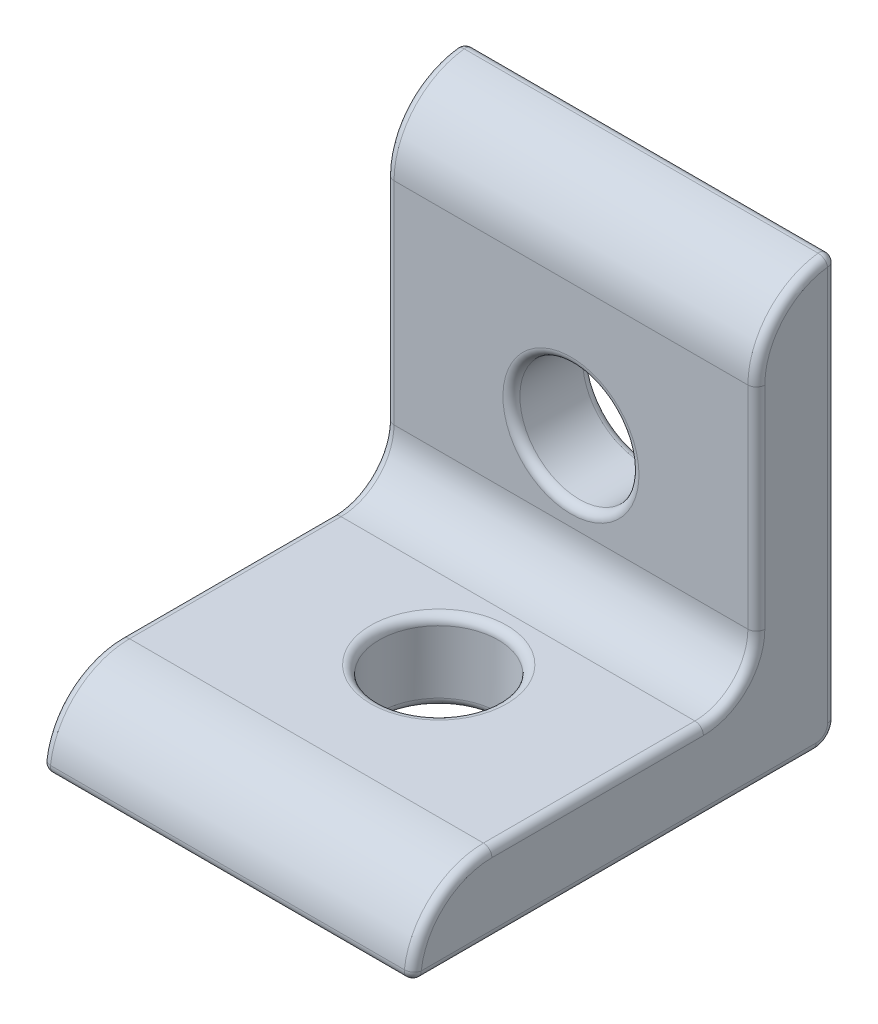
ISO-10303-21;
HEADER;
FILE_DESCRIPTION(('STEP AP214'),'2;1');
FILE_NAME('part.step','',(''),(''),'','','');
FILE_SCHEMA(('AUTOMOTIVE_DESIGN { 1 0 10303 214 1 1 1 1 }'));
ENDSEC;
DATA;
#1=APPLICATION_CONTEXT('core data for automotive mechanical design processes');
#2=APPLICATION_PROTOCOL_DEFINITION('international standard','automotive_design',2000,#1);
#3=PRODUCT_CONTEXT('',#1,'mechanical');
#4=PRODUCT('Part','Part','',(#3));
#5=PRODUCT_RELATED_PRODUCT_CATEGORY('part','',(#4));
#6=PRODUCT_DEFINITION_FORMATION('','',#4);
#7=PRODUCT_DEFINITION_CONTEXT('part definition',#1,'design');
#8=PRODUCT_DEFINITION('design','',#6,#7);
#9=PRODUCT_DEFINITION_SHAPE('','',#8);
#10=(LENGTH_UNIT() NAMED_UNIT(*) SI_UNIT(.MILLI.,.METRE.));
#11=(NAMED_UNIT(*) PLANE_ANGLE_UNIT() SI_UNIT($,.RADIAN.));
#12=(NAMED_UNIT(*) SI_UNIT($,.STERADIAN.) SOLID_ANGLE_UNIT());
#13=UNCERTAINTY_MEASURE_WITH_UNIT(LENGTH_MEASURE(1.E-05),#10,'distance_accuracy_value','');
#14=(GEOMETRIC_REPRESENTATION_CONTEXT(3) GLOBAL_UNCERTAINTY_ASSIGNED_CONTEXT((#13)) GLOBAL_UNIT_ASSIGNED_CONTEXT((#10,
#11,#12)) REPRESENTATION_CONTEXT('',''));
#15=CARTESIAN_POINT('',(0.,0.,0.));
#16=DIRECTION('',(0.,0.,1.));
#17=DIRECTION('',(1.,0.,0.));
#18=AXIS2_PLACEMENT_3D('',#15,#16,#17);
#19=CARTESIAN_POINT('',(-11.1125,-12.7,15.8496));
#20=DIRECTION('',(1.,0.,0.));
#21=DIRECTION('',(0.,0.,-1.));
#22=AXIS2_PLACEMENT_3D('',#19,#20,#21);
#23=CYLINDRICAL_SURFACE('',#22,4.7752);
#24=DIRECTION('',(1.,0.,0.));
#25=VECTOR('',#24,1.);
#26=CARTESIAN_POINT('',(-11.1125,-7.9248,15.8496));
#27=LINE('',#26,#25);
#28=CARTESIAN_POINT('',(-10.6045,-7.9248,15.8496));
#29=VERTEX_POINT('',#28);
#30=CARTESIAN_POINT('',(10.6045,-7.9248,15.8496));
#31=VERTEX_POINT('',#30);
#32=EDGE_CURVE('E215',#29,#31,#27,.T.);
#33=ORIENTED_EDGE('',*,*,#32,.F.);
#34=CARTESIAN_POINT('',(-10.6045,-12.7,15.8496));
#35=DIRECTION('',(1.,0.,0.));
#36=DIRECTION('',(0.,0.,-1.));
#37=AXIS2_PLACEMENT_3D('',#34,#35,#36);
#38=CIRCLE('',#37,4.7752);
#39=CARTESIAN_POINT('',(-10.6045,-12.1315238095238,20.5908413839481));
#40=VERTEX_POINT('',#39);
#41=EDGE_CURVE('E290',#29,#40,#38,.T.);
#42=ORIENTED_EDGE('',*,*,#41,.T.);
#43=DIRECTION('',(1.,0.,0.));
#44=VECTOR('',#43,1.);
#45=CARTESIAN_POINT('',(-11.1125,-12.1315238095238,20.5908413839481));
#46=LINE('',#45,#44);
#47=CARTESIAN_POINT('',(10.6045,-12.1315238095238,20.5908413839481));
#48=VERTEX_POINT('',#47);
#49=EDGE_CURVE('E284',#40,#48,#46,.T.);
#50=ORIENTED_EDGE('',*,*,#49,.T.);
#51=CARTESIAN_POINT('',(10.6045,-12.7,15.8496));
#52=DIRECTION('',(1.,0.,0.));
#53=DIRECTION('',(0.,0.,-1.));
#54=AXIS2_PLACEMENT_3D('',#51,#52,#53);
#55=CIRCLE('',#54,4.7752);
#56=EDGE_CURVE('E287',#48,#31,#55,.F.);
#57=ORIENTED_EDGE('',*,*,#56,.T.);
#58=EDGE_LOOP('',(#33,#42,#50,#57));
#59=FACE_BOUND('',#58,.T.);
#60=ADVANCED_FACE('F47',(#59),#23,.T.);
#61=CARTESIAN_POINT('',(-11.1125,-7.9248,3.175));
#62=DIRECTION('',(0.,1.,0.));
#63=DIRECTION('',(0.,0.,1.));
#64=AXIS2_PLACEMENT_3D('',#61,#62,#63);
#65=PLANE('',#64);
#66=CARTESIAN_POINT('',(0.,-7.9248,7.9248));
#67=DIRECTION('',(0.,1.,0.));
#68=DIRECTION('',(0.,0.,1.));
#69=AXIS2_PLACEMENT_3D('',#66,#67,#68);
#70=CIRCLE('',#69,4.0767);
#71=CARTESIAN_POINT('',(0.,-7.9248,12.0015));
#72=VERTEX_POINT('',#71);
#73=EDGE_CURVE('E422',#72,#72,#70,.F.);
#74=ORIENTED_EDGE('',*,*,#73,.T.);
#75=EDGE_LOOP('',(#74));
#76=FACE_BOUND('',#75,.T.);
#77=DIRECTION('',(1.,0.,0.));
#78=VECTOR('',#77,1.);
#79=CARTESIAN_POINT('',(-11.1125,-7.9248,3.175));
#80=LINE('',#79,#78);
#81=CARTESIAN_POINT('',(-10.6045,-7.9248,3.175));
#82=VERTEX_POINT('',#81);
#83=CARTESIAN_POINT('',(10.6045,-7.9248,3.175));
#84=VERTEX_POINT('',#83);
#85=EDGE_CURVE('E222',#82,#84,#80,.T.);
#86=ORIENTED_EDGE('',*,*,#85,.F.);
#87=DIRECTION('',(0.,0.,1.));
#88=VECTOR('',#87,1.);
#89=CARTESIAN_POINT('',(-10.6045,-7.9248,15.8496));
#90=LINE('',#89,#88);
#91=EDGE_CURVE('E297',#82,#29,#90,.T.);
#92=ORIENTED_EDGE('',*,*,#91,.T.);
#93=ORIENTED_EDGE('',*,*,#32,.T.);
#94=DIRECTION('',(0.,0.,1.));
#95=VECTOR('',#94,1.);
#96=CARTESIAN_POINT('',(10.6045,-7.9248,3.175));
#97=LINE('',#96,#95);
#98=EDGE_CURVE('E294',#31,#84,#97,.F.);
#99=ORIENTED_EDGE('',*,*,#98,.T.);
#100=EDGE_LOOP('',(#86,#92,#93,#99));
#101=FACE_BOUND('',#100,.T.);
#102=ADVANCED_FACE('F531',(#76,#101),#65,.T.);
#103=CARTESIAN_POINT('',(-11.1125,-4.7498,3.175));
#104=DIRECTION('',(1.,0.,0.));
#105=DIRECTION('',(0.,0.,-1.));
#106=AXIS2_PLACEMENT_3D('',#103,#104,#105);
#107=CYLINDRICAL_SURFACE('',#106,3.175);
#108=DIRECTION('',(1.,0.,0.));
#109=VECTOR('',#108,1.);
#110=CARTESIAN_POINT('',(-11.1125,-4.7498,0.));
#111=LINE('',#110,#109);
#112=CARTESIAN_POINT('',(-10.6045,-4.7498,0.));
#113=VERTEX_POINT('',#112);
#114=CARTESIAN_POINT('',(10.6045,-4.7498,0.));
#115=VERTEX_POINT('',#114);
#116=EDGE_CURVE('E613',#113,#115,#111,.T.);
#117=ORIENTED_EDGE('',*,*,#116,.F.);
#118=CARTESIAN_POINT('',(-10.6045,-4.7498,3.175));
#119=DIRECTION('',(1.,0.,0.));
#120=DIRECTION('',(0.,0.,-1.));
#121=AXIS2_PLACEMENT_3D('',#118,#119,#120);
#122=CIRCLE('',#121,3.175);
#123=EDGE_CURVE('E303',#113,#82,#122,.F.);
#124=ORIENTED_EDGE('',*,*,#123,.T.);
#125=ORIENTED_EDGE('',*,*,#85,.T.);
#126=CARTESIAN_POINT('',(10.6045,-4.7498,3.175));
#127=DIRECTION('',(1.,0.,0.));
#128=DIRECTION('',(0.,0.,-1.));
#129=AXIS2_PLACEMENT_3D('',#126,#127,#128);
#130=CIRCLE('',#129,3.175);
#131=EDGE_CURVE('E300',#84,#115,#130,.T.);
#132=ORIENTED_EDGE('',*,*,#131,.T.);
#133=EDGE_LOOP('',(#117,#124,#125,#132));
#134=FACE_BOUND('',#133,.T.);
#135=ADVANCED_FACE('F537',(#134),#107,.F.);
#136=CARTESIAN_POINT('',(-11.1125,7.9248,0.));
#137=DIRECTION('',(0.,0.,1.));
#138=DIRECTION('',(0.,-1.,0.));
#139=AXIS2_PLACEMENT_3D('',#136,#137,#138);
#140=PLANE('',#139);
#141=CARTESIAN_POINT('',(0.,0.,0.));
#142=DIRECTION('',(0.,0.,1.));
#143=DIRECTION('',(0.,-1.,0.));
#144=AXIS2_PLACEMENT_3D('',#141,#142,#143);
#145=CIRCLE('',#144,4.0767);
#146=CARTESIAN_POINT('',(0.,-4.0767,0.));
#147=VERTEX_POINT('',#146);
#148=EDGE_CURVE('E56',#147,#147,#145,.F.);
#149=ORIENTED_EDGE('',*,*,#148,.T.);
#150=EDGE_LOOP('',(#149));
#151=FACE_BOUND('',#150,.T.);
#152=DIRECTION('',(1.,0.,0.));
#153=VECTOR('',#152,1.);
#154=CARTESIAN_POINT('',(-11.1125,7.9248,0.));
#155=LINE('',#154,#153);
#156=CARTESIAN_POINT('',(-10.6045,7.9248,0.));
#157=VERTEX_POINT('',#156);
#158=CARTESIAN_POINT('',(10.6045,7.9248,0.));
#159=VERTEX_POINT('',#158);
#160=EDGE_CURVE('E225',#157,#159,#155,.T.);
#161=ORIENTED_EDGE('',*,*,#160,.F.);
#162=DIRECTION('',(0.,-1.,0.));
#163=VECTOR('',#162,1.);
#164=CARTESIAN_POINT('',(-10.6045,-4.7498,0.));
#165=LINE('',#164,#163);
#166=EDGE_CURVE('E309',#157,#113,#165,.T.);
#167=ORIENTED_EDGE('',*,*,#166,.T.);
#168=ORIENTED_EDGE('',*,*,#116,.T.);
#169=DIRECTION('',(0.,-1.,0.));
#170=VECTOR('',#169,1.);
#171=CARTESIAN_POINT('',(10.6045,7.9248,0.));
#172=LINE('',#171,#170);
#173=EDGE_CURVE('E306',#115,#159,#172,.F.);
#174=ORIENTED_EDGE('',*,*,#173,.T.);
#175=EDGE_LOOP('',(#161,#167,#168,#174));
#176=FACE_BOUND('',#175,.T.);
#177=ADVANCED_FACE('F438',(#151,#176),#140,.T.);
#178=CARTESIAN_POINT('',(-11.1125,7.9248,-4.7752));
#179=DIRECTION('',(1.,0.,0.));
#180=DIRECTION('',(0.,0.,-1.));
#181=AXIS2_PLACEMENT_3D('',#178,#179,#180);
#182=CYLINDRICAL_SURFACE('',#181,4.7752);
#183=DIRECTION('',(1.,0.,0.));
#184=VECTOR('',#183,1.);
#185=CARTESIAN_POINT('',(-11.1125,12.6660413839481,-4.20672380952381));
#186=LINE('',#185,#184);
#187=CARTESIAN_POINT('',(10.6045,12.6660413839481,-4.20672380952381));
#188=VERTEX_POINT('',#187);
#189=CARTESIAN_POINT('',(-10.6045,12.6660413839481,-4.20672380952381));
#190=VERTEX_POINT('',#189);
#191=EDGE_CURVE('E63',#188,#190,#186,.F.);
#192=ORIENTED_EDGE('',*,*,#191,.T.);
#193=CARTESIAN_POINT('',(-10.6045,7.9248,-4.7752));
#194=DIRECTION('',(1.,0.,0.));
#195=DIRECTION('',(0.,0.,-1.));
#196=AXIS2_PLACEMENT_3D('',#193,#194,#195);
#197=CIRCLE('',#196,4.7752);
#198=EDGE_CURVE('E329',#190,#157,#197,.T.);
#199=ORIENTED_EDGE('',*,*,#198,.T.);
#200=ORIENTED_EDGE('',*,*,#160,.T.);
#201=CARTESIAN_POINT('',(10.6045,7.9248,-4.7752));
#202=DIRECTION('',(1.,0.,0.));
#203=DIRECTION('',(0.,0.,-1.));
#204=AXIS2_PLACEMENT_3D('',#201,#202,#203);
#205=CIRCLE('',#204,4.7752);
#206=EDGE_CURVE('E68',#159,#188,#205,.F.);
#207=ORIENTED_EDGE('',*,*,#206,.T.);
#208=EDGE_LOOP('',(#192,#199,#200,#207));
#209=FACE_BOUND('',#208,.T.);
#210=ADVANCED_FACE('F461',(#209),#182,.T.);
#211=CARTESIAN_POINT('',(-11.1125,-12.7,-4.7752));
#212=DIRECTION('',(0.,0.,-1.));
#213=DIRECTION('',(-1.,0.,0.));
#214=AXIS2_PLACEMENT_3D('',#211,#212,#213);
#215=PLANE('',#214);
#216=CARTESIAN_POINT('',(0.,0.,-4.7752));
#217=DIRECTION('',(0.,0.,-1.));
#218=DIRECTION('',(-1.,0.,0.));
#219=AXIS2_PLACEMENT_3D('',#216,#217,#218);
#220=CIRCLE('',#219,4.0767);
#221=CARTESIAN_POINT('',(-4.0767,0.,-4.7752));
#222=VERTEX_POINT('',#221);
#223=EDGE_CURVE('E11',#222,#222,#220,.F.);
#224=ORIENTED_EDGE('',*,*,#223,.T.);
#225=EDGE_LOOP('',(#224));
#226=FACE_BOUND('',#225,.T.);
#227=DIRECTION('',(1.,0.,0.));
#228=VECTOR('',#227,1.);
#229=CARTESIAN_POINT('',(-11.1125,-11.5062,-4.7752));
#230=LINE('',#229,#228);
#231=CARTESIAN_POINT('',(10.6045,-11.5062,-4.7752));
#232=VERTEX_POINT('',#231);
#233=CARTESIAN_POINT('',(-10.6045,-11.5062,-4.7752));
#234=VERTEX_POINT('',#233);
#235=EDGE_CURVE('E214',#232,#234,#230,.F.);
#236=ORIENTED_EDGE('',*,*,#235,.T.);
#237=DIRECTION('',(0.,1.,0.));
#238=VECTOR('',#237,1.);
#239=CARTESIAN_POINT('',(-10.6045,12.7,-4.7752));
#240=LINE('',#239,#238);
#241=CARTESIAN_POINT('',(-10.6045,12.161654002677,-4.7752));
#242=VERTEX_POINT('',#241);
#243=EDGE_CURVE('E322',#234,#242,#240,.T.);
#244=ORIENTED_EDGE('',*,*,#243,.T.);
#245=DIRECTION('',(1.,0.,0.));
#246=VECTOR('',#245,1.);
#247=CARTESIAN_POINT('',(-11.1125,12.161654002677,-4.7752));
#248=LINE('',#247,#246);
#249=CARTESIAN_POINT('',(10.6045,12.161654002677,-4.7752));
#250=VERTEX_POINT('',#249);
#251=EDGE_CURVE('E319',#242,#250,#248,.T.);
#252=ORIENTED_EDGE('',*,*,#251,.T.);
#253=DIRECTION('',(0.,1.,0.));
#254=VECTOR('',#253,1.);
#255=CARTESIAN_POINT('',(10.6045,-12.7,-4.7752));
#256=LINE('',#255,#254);
#257=EDGE_CURVE('E316',#250,#232,#256,.F.);
#258=ORIENTED_EDGE('',*,*,#257,.T.);
#259=EDGE_LOOP('',(#236,#244,#252,#258));
#260=FACE_BOUND('',#259,.T.);
#261=ADVANCED_FACE('F458',(#226,#260),#215,.T.);
#262=CARTESIAN_POINT('',(-11.1125,-12.7,20.6248));
#263=DIRECTION('',(0.,-1.,0.));
#264=DIRECTION('',(0.,0.,-1.));
#265=AXIS2_PLACEMENT_3D('',#262,#263,#264);
#266=PLANE('',#265);
#267=CARTESIAN_POINT('',(0.,-12.7,7.9248));
#268=DIRECTION('',(0.,-1.,0.));
#269=DIRECTION('',(0.,0.,-1.));
#270=AXIS2_PLACEMENT_3D('',#267,#268,#269);
#271=CIRCLE('',#270,4.0767);
#272=CARTESIAN_POINT('',(0.,-12.7,3.8481));
#273=VERTEX_POINT('',#272);
#274=EDGE_CURVE('E208',#273,#273,#271,.F.);
#275=ORIENTED_EDGE('',*,*,#274,.T.);
#276=EDGE_LOOP('',(#275));
#277=FACE_BOUND('',#276,.T.);
#278=DIRECTION('',(1.,0.,0.));
#279=VECTOR('',#278,1.);
#280=CARTESIAN_POINT('',(-11.1125,-12.7,20.086454002677));
#281=LINE('',#280,#279);
#282=CARTESIAN_POINT('',(10.6045,-12.7,20.086454002677));
#283=VERTEX_POINT('',#282);
#284=CARTESIAN_POINT('',(-10.6045,-12.7,20.086454002677));
#285=VERTEX_POINT('',#284);
#286=EDGE_CURVE('E205',#283,#285,#281,.F.);
#287=ORIENTED_EDGE('',*,*,#286,.T.);
#288=DIRECTION('',(0.,0.,-1.));
#289=VECTOR('',#288,1.);
#290=CARTESIAN_POINT('',(-10.6045,-12.7,-3.5814));
#291=LINE('',#290,#289);
#292=CARTESIAN_POINT('',(-10.6045,-12.7,-3.5814));
#293=VERTEX_POINT('',#292);
#294=EDGE_CURVE('E178',#285,#293,#291,.T.);
#295=ORIENTED_EDGE('',*,*,#294,.T.);
#296=DIRECTION('',(1.,0.,0.));
#297=VECTOR('',#296,1.);
#298=CARTESIAN_POINT('',(-11.1125,-12.7,-3.5814));
#299=LINE('',#298,#297);
#300=CARTESIAN_POINT('',(10.6045,-12.7,-3.5814));
#301=VERTEX_POINT('',#300);
#302=EDGE_CURVE('E202',#293,#301,#299,.T.);
#303=ORIENTED_EDGE('',*,*,#302,.T.);
#304=DIRECTION('',(0.,0.,-1.));
#305=VECTOR('',#304,1.);
#306=CARTESIAN_POINT('',(10.6045,-12.7,20.6248));
#307=LINE('',#306,#305);
#308=EDGE_CURVE('E209',#301,#283,#307,.F.);
#309=ORIENTED_EDGE('',*,*,#308,.T.);
#310=EDGE_LOOP('',(#287,#295,#303,#309));
#311=FACE_BOUND('',#310,.T.);
#312=ADVANCED_FACE('F201',(#277,#311),#266,.T.);
#313=CARTESIAN_POINT('',(-11.1125,-12.7,15.8496));
#314=DIRECTION('',(1.,0.,0.));
#315=DIRECTION('',(0.,0.,-1.));
#316=AXIS2_PLACEMENT_3D('',#313,#314,#315);
#317=PLANE('',#316);
#318=CARTESIAN_POINT('',(-11.1125,-11.5062,-3.5814));
#319=DIRECTION('',(1.,0.,0.));
#320=DIRECTION('',(0.,0.,-1.));
#321=AXIS2_PLACEMENT_3D('',#318,#319,#320);
#322=CIRCLE('',#321,0.6858);
#323=CARTESIAN_POINT('',(-11.1125,-11.5062,-4.2672));
#324=VERTEX_POINT('',#323);
#325=CARTESIAN_POINT('',(-11.1125,-12.192,-3.5814));
#326=VERTEX_POINT('',#325);
#327=EDGE_CURVE('E253',#324,#326,#322,.F.);
#328=ORIENTED_EDGE('',*,*,#327,.T.);
#329=DIRECTION('',(0.,0.,-1.));
#330=VECTOR('',#329,1.);
#331=CARTESIAN_POINT('',(-11.1125,-12.192,20.6248));
#332=LINE('',#331,#330);
#333=CARTESIAN_POINT('',(-11.1125,-12.192,20.086454002677));
#334=VERTEX_POINT('',#333);
#335=EDGE_CURVE('E180',#326,#334,#332,.F.);
#336=ORIENTED_EDGE('',*,*,#335,.T.);
#337=CARTESIAN_POINT('',(-11.1125,-12.7,15.8496));
#338=DIRECTION('',(1.,0.,0.));
#339=DIRECTION('',(0.,0.,-1.));
#340=AXIS2_PLACEMENT_3D('',#337,#338,#339);
#341=CIRCLE('',#340,4.2672);
#342=CARTESIAN_POINT('',(-11.1125,-8.4328,15.8496));
#343=VERTEX_POINT('',#342);
#344=EDGE_CURVE('E250',#334,#343,#341,.F.);
#345=ORIENTED_EDGE('',*,*,#344,.T.);
#346=DIRECTION('',(0.,0.,1.));
#347=VECTOR('',#346,1.);
#348=CARTESIAN_POINT('',(-11.1125,-8.4328,3.175));
#349=LINE('',#348,#347);
#350=CARTESIAN_POINT('',(-11.1125,-8.4328,3.175));
#351=VERTEX_POINT('',#350);
#352=EDGE_CURVE('E247',#343,#351,#349,.F.);
#353=ORIENTED_EDGE('',*,*,#352,.T.);
#354=CARTESIAN_POINT('',(-11.1125,-4.7498,3.175));
#355=DIRECTION('',(1.,0.,0.));
#356=DIRECTION('',(0.,0.,-1.));
#357=AXIS2_PLACEMENT_3D('',#354,#355,#356);
#358=CIRCLE('',#357,3.683);
#359=CARTESIAN_POINT('',(-11.1125,-4.7498,-0.508000000000003));
#360=VERTEX_POINT('',#359);
#361=EDGE_CURVE('E244',#351,#360,#358,.T.);
#362=ORIENTED_EDGE('',*,*,#361,.T.);
#363=DIRECTION('',(0.,-1.,0.));
#364=VECTOR('',#363,1.);
#365=CARTESIAN_POINT('',(-11.1125,7.9248,-0.508000000000001));
#366=LINE('',#365,#364);
#367=CARTESIAN_POINT('',(-11.1125,7.9248,-0.508));
#368=VERTEX_POINT('',#367);
#369=EDGE_CURVE('E241',#360,#368,#366,.F.);
#370=ORIENTED_EDGE('',*,*,#369,.T.);
#371=CARTESIAN_POINT('',(-11.1125,7.9248,-4.7752));
#372=DIRECTION('',(1.,0.,0.));
#373=DIRECTION('',(0.,0.,-1.));
#374=AXIS2_PLACEMENT_3D('',#371,#372,#373);
#375=CIRCLE('',#374,4.2672);
#376=CARTESIAN_POINT('',(-11.1125,12.161654002677,-4.2672));
#377=VERTEX_POINT('',#376);
#378=EDGE_CURVE('E235',#368,#377,#375,.F.);
#379=ORIENTED_EDGE('',*,*,#378,.T.);
#380=DIRECTION('',(0.,1.,0.));
#381=VECTOR('',#380,1.);
#382=CARTESIAN_POINT('',(-11.1125,-11.5062,-4.2672));
#383=LINE('',#382,#381);
#384=EDGE_CURVE('E238',#377,#324,#383,.F.);
#385=ORIENTED_EDGE('',*,*,#384,.T.);
#386=EDGE_LOOP('',(#328,#336,#345,#353,#362,#370,#379,#385));
#387=FACE_BOUND('',#386,.T.);
#388=ADVANCED_FACE('F596',(#387),#317,.F.);
#389=CARTESIAN_POINT('',(11.1125,-12.7,15.8496));
#390=DIRECTION('',(1.,0.,0.));
#391=DIRECTION('',(0.,0.,-1.));
#392=AXIS2_PLACEMENT_3D('',#389,#390,#391);
#393=PLANE('',#392);
#394=CARTESIAN_POINT('',(11.1125,-12.7,15.8496));
#395=DIRECTION('',(1.,0.,0.));
#396=DIRECTION('',(0.,0.,-1.));
#397=AXIS2_PLACEMENT_3D('',#394,#395,#396);
#398=CIRCLE('',#397,4.2672);
#399=CARTESIAN_POINT('',(11.1125,-8.4328,15.8496));
#400=VERTEX_POINT('',#399);
#401=CARTESIAN_POINT('',(11.1125,-12.192,20.086454002677));
#402=VERTEX_POINT('',#401);
#403=EDGE_CURVE('E274',#400,#402,#398,.T.);
#404=ORIENTED_EDGE('',*,*,#403,.T.);
#405=DIRECTION('',(0.,0.,-1.));
#406=VECTOR('',#405,1.);
#407=CARTESIAN_POINT('',(11.1125,-12.192,15.8496));
#408=LINE('',#407,#406);
#409=CARTESIAN_POINT('',(11.1125,-12.192,-3.5814));
#410=VERTEX_POINT('',#409);
#411=EDGE_CURVE('E280',#402,#410,#408,.T.);
#412=ORIENTED_EDGE('',*,*,#411,.T.);
#413=CARTESIAN_POINT('',(11.1125,-11.5062,-3.5814));
#414=DIRECTION('',(1.,0.,0.));
#415=DIRECTION('',(0.,0.,-1.));
#416=AXIS2_PLACEMENT_3D('',#413,#414,#415);
#417=CIRCLE('',#416,0.6858);
#418=CARTESIAN_POINT('',(11.1125,-11.5062,-4.2672));
#419=VERTEX_POINT('',#418);
#420=EDGE_CURVE('E277',#410,#419,#417,.T.);
#421=ORIENTED_EDGE('',*,*,#420,.T.);
#422=DIRECTION('',(0.,1.,0.));
#423=VECTOR('',#422,1.);
#424=CARTESIAN_POINT('',(11.1125,-12.7,-4.2672));
#425=LINE('',#424,#423);
#426=CARTESIAN_POINT('',(11.1125,12.161654002677,-4.2672));
#427=VERTEX_POINT('',#426);
#428=EDGE_CURVE('E262',#419,#427,#425,.T.);
#429=ORIENTED_EDGE('',*,*,#428,.T.);
#430=CARTESIAN_POINT('',(11.1125,7.9248,-4.7752));
#431=DIRECTION('',(1.,0.,0.));
#432=DIRECTION('',(0.,0.,-1.));
#433=AXIS2_PLACEMENT_3D('',#430,#431,#432);
#434=CIRCLE('',#433,4.2672);
#435=CARTESIAN_POINT('',(11.1125,7.9248,-0.508));
#436=VERTEX_POINT('',#435);
#437=EDGE_CURVE('E196',#427,#436,#434,.T.);
#438=ORIENTED_EDGE('',*,*,#437,.T.);
#439=DIRECTION('',(0.,-1.,0.));
#440=VECTOR('',#439,1.);
#441=CARTESIAN_POINT('',(11.1125,-12.7,-0.508000000000005));
#442=LINE('',#441,#440);
#443=CARTESIAN_POINT('',(11.1125,-4.7498,-0.508000000000004));
#444=VERTEX_POINT('',#443);
#445=EDGE_CURVE('E265',#436,#444,#442,.T.);
#446=ORIENTED_EDGE('',*,*,#445,.T.);
#447=CARTESIAN_POINT('',(11.1125,-4.7498,3.175));
#448=DIRECTION('',(1.,0.,0.));
#449=DIRECTION('',(0.,0.,-1.));
#450=AXIS2_PLACEMENT_3D('',#447,#448,#449);
#451=CIRCLE('',#450,3.683);
#452=CARTESIAN_POINT('',(11.1125,-8.4328,3.175));
#453=VERTEX_POINT('',#452);
#454=EDGE_CURVE('E268',#444,#453,#451,.F.);
#455=ORIENTED_EDGE('',*,*,#454,.T.);
#456=DIRECTION('',(0.,0.,1.));
#457=VECTOR('',#456,1.);
#458=CARTESIAN_POINT('',(11.1125,-8.4328,15.8496));
#459=LINE('',#458,#457);
#460=EDGE_CURVE('E271',#453,#400,#459,.T.);
#461=ORIENTED_EDGE('',*,*,#460,.T.);
#462=EDGE_LOOP('',(#404,#412,#421,#429,#438,#446,#455,#461));
#463=FACE_BOUND('',#462,.T.);
#464=ADVANCED_FACE('F490',(#463),#393,.T.);
#465=CARTESIAN_POINT('',(-11.1125,-11.5062,-3.5814));
#466=DIRECTION('',(1.,0.,0.));
#467=DIRECTION('',(0.,0.,-1.));
#468=AXIS2_PLACEMENT_3D('',#465,#466,#467);
#469=CYLINDRICAL_SURFACE('',#468,1.1938);
#470=ORIENTED_EDGE('',*,*,#302,.F.);
#471=CARTESIAN_POINT('',(-10.6045,-11.5062,-3.5814));
#472=DIRECTION('',(1.,0.,0.));
#473=DIRECTION('',(0.,0.,-1.));
#474=AXIS2_PLACEMENT_3D('',#471,#472,#473);
#475=CIRCLE('',#474,1.1938);
#476=EDGE_CURVE('E187',#293,#234,#475,.T.);
#477=ORIENTED_EDGE('',*,*,#476,.T.);
#478=ORIENTED_EDGE('',*,*,#235,.F.);
#479=CARTESIAN_POINT('',(10.6045,-11.5062,-3.5814));
#480=DIRECTION('',(1.,0.,0.));
#481=DIRECTION('',(0.,0.,-1.));
#482=AXIS2_PLACEMENT_3D('',#479,#480,#481);
#483=CIRCLE('',#482,1.1938);
#484=EDGE_CURVE('E197',#232,#301,#483,.F.);
#485=ORIENTED_EDGE('',*,*,#484,.T.);
#486=EDGE_LOOP('',(#470,#477,#478,#485));
#487=FACE_BOUND('',#486,.T.);
#488=ADVANCED_FACE('F211',(#487),#469,.T.);
#489=CARTESIAN_POINT('',(0.,0.,-4.7752));
#490=DIRECTION('',(0.,0.,1.));
#491=DIRECTION('',(1.,0.,0.));
#492=AXIS2_PLACEMENT_3D('',#489,#490,#491);
#493=CYLINDRICAL_SURFACE('',#492,3.5687);
#494=CARTESIAN_POINT('',(0.,0.,-0.508000000000002));
#495=DIRECTION('',(0.,0.,1.));
#496=DIRECTION('',(0.,-1.,0.));
#497=AXIS2_PLACEMENT_3D('',#494,#495,#496);
#498=CIRCLE('',#497,3.5687);
#499=CARTESIAN_POINT('',(0.,-3.5687,-0.508000000000002));
#500=VERTEX_POINT('',#499);
#501=EDGE_CURVE('E430',#500,#500,#498,.T.);
#502=ORIENTED_EDGE('',*,*,#501,.T.);
#503=EDGE_LOOP('',(#502));
#504=FACE_BOUND('',#503,.T.);
#505=CARTESIAN_POINT('',(0.,0.,-4.2672));
#506=DIRECTION('',(0.,0.,-1.));
#507=DIRECTION('',(-1.,0.,0.));
#508=AXIS2_PLACEMENT_3D('',#505,#506,#507);
#509=CIRCLE('',#508,3.5687);
#510=CARTESIAN_POINT('',(-3.5687,0.,-4.2672));
#511=VERTEX_POINT('',#510);
#512=EDGE_CURVE('E426',#511,#511,#509,.T.);
#513=ORIENTED_EDGE('',*,*,#512,.T.);
#514=EDGE_LOOP('',(#513));
#515=FACE_BOUND('',#514,.T.);
#516=ADVANCED_FACE('F447',(#504,#515),#493,.F.);
#517=CARTESIAN_POINT('',(0.,-12.7,7.9248));
#518=DIRECTION('',(0.,1.,0.));
#519=DIRECTION('',(0.,0.,1.));
#520=AXIS2_PLACEMENT_3D('',#517,#518,#519);
#521=CYLINDRICAL_SURFACE('',#520,3.5687);
#522=CARTESIAN_POINT('',(0.,-8.4328,7.9248));
#523=DIRECTION('',(0.,1.,0.));
#524=DIRECTION('',(0.,0.,1.));
#525=AXIS2_PLACEMENT_3D('',#522,#523,#524);
#526=CIRCLE('',#525,3.5687);
#527=CARTESIAN_POINT('',(0.,-8.4328,11.4935));
#528=VERTEX_POINT('',#527);
#529=EDGE_CURVE('E331',#528,#528,#526,.T.);
#530=ORIENTED_EDGE('',*,*,#529,.T.);
#531=EDGE_LOOP('',(#530));
#532=FACE_BOUND('',#531,.T.);
#533=CARTESIAN_POINT('',(0.,-12.192,7.9248));
#534=DIRECTION('',(0.,-1.,0.));
#535=DIRECTION('',(0.,0.,-1.));
#536=AXIS2_PLACEMENT_3D('',#533,#534,#535);
#537=CIRCLE('',#536,3.5687);
#538=CARTESIAN_POINT('',(0.,-12.192,4.3561));
#539=VERTEX_POINT('',#538);
#540=EDGE_CURVE('E312',#539,#539,#537,.T.);
#541=ORIENTED_EDGE('',*,*,#540,.T.);
#542=EDGE_LOOP('',(#541));
#543=FACE_BOUND('',#542,.T.);
#544=ADVANCED_FACE('F450',(#532,#543),#521,.F.);
#545=CARTESIAN_POINT('',(10.6045,-12.7,-0.508000000000005));
#546=DIRECTION('',(0.,-1.,0.));
#547=DIRECTION('',(0.,0.,-1.));
#548=AXIS2_PLACEMENT_3D('',#545,#546,#547);
#549=CYLINDRICAL_SURFACE('',#548,0.508);
#550=CARTESIAN_POINT('',(10.6045,7.9248,-0.508000000000001));
#551=DIRECTION('',(0.,1.,0.));
#552=DIRECTION('',(0.,0.,1.));
#553=AXIS2_PLACEMENT_3D('',#550,#551,#552);
#554=CIRCLE('',#553,0.508);
#555=EDGE_CURVE('E411',#159,#436,#554,.T.);
#556=ORIENTED_EDGE('',*,*,#555,.F.);
#557=ORIENTED_EDGE('',*,*,#173,.F.);
#558=CARTESIAN_POINT('',(10.6045,-4.7498,-0.508000000000004));
#559=DIRECTION('',(0.,-1.,0.));
#560=DIRECTION('',(0.,0.,-1.));
#561=AXIS2_PLACEMENT_3D('',#558,#559,#560);
#562=CIRCLE('',#561,0.508);
#563=EDGE_CURVE('E415',#444,#115,#562,.T.);
#564=ORIENTED_EDGE('',*,*,#563,.F.);
#565=ORIENTED_EDGE('',*,*,#445,.F.);
#566=EDGE_LOOP('',(#556,#557,#564,#565));
#567=FACE_BOUND('',#566,.T.);
#568=ADVANCED_FACE('F493',(#567),#549,.T.);
#569=CARTESIAN_POINT('',(10.6045,-4.7498,3.175));
#570=DIRECTION('',(1.,0.,0.));
#571=DIRECTION('',(0.,0.,-1.));
#572=AXIS2_PLACEMENT_3D('',#569,#570,#571);
#573=TOROIDAL_SURFACE('',#572,3.683,0.508);
#574=ORIENTED_EDGE('',*,*,#563,.T.);
#575=ORIENTED_EDGE('',*,*,#131,.F.);
#576=CARTESIAN_POINT('',(10.6045,-8.4328,3.175));
#577=DIRECTION('',(0.,0.,1.));
#578=DIRECTION('',(1.,0.,0.));
#579=AXIS2_PLACEMENT_3D('',#576,#577,#578);
#580=CIRCLE('',#579,0.508);
#581=EDGE_CURVE('E407',#453,#84,#580,.T.);
#582=ORIENTED_EDGE('',*,*,#581,.F.);
#583=ORIENTED_EDGE('',*,*,#454,.F.);
#584=EDGE_LOOP('',(#574,#575,#582,#583));
#585=FACE_BOUND('',#584,.T.);
#586=ADVANCED_FACE('F499',(#585),#573,.T.);
#587=CARTESIAN_POINT('',(10.6045,-12.7,-4.2672));
#588=DIRECTION('',(0.,1.,0.));
#589=DIRECTION('',(0.,0.,1.));
#590=AXIS2_PLACEMENT_3D('',#587,#588,#589);
#591=CYLINDRICAL_SURFACE('',#590,0.508);
#592=CARTESIAN_POINT('',(10.6045,12.161654002677,-4.2672));
#593=DIRECTION('',(0.,1.,0.));
#594=DIRECTION('',(0.,0.,1.));
#595=AXIS2_PLACEMENT_3D('',#592,#593,#594);
#596=CIRCLE('',#595,0.508);
#597=EDGE_CURVE('E399',#427,#250,#596,.T.);
#598=ORIENTED_EDGE('',*,*,#597,.F.);
#599=ORIENTED_EDGE('',*,*,#428,.F.);
#600=CARTESIAN_POINT('',(10.6045,-11.5062,-4.2672));
#601=DIRECTION('',(0.,-1.,0.));
#602=DIRECTION('',(0.,0.,-1.));
#603=AXIS2_PLACEMENT_3D('',#600,#601,#602);
#604=CIRCLE('',#603,0.508);
#605=EDGE_CURVE('E403',#232,#419,#604,.T.);
#606=ORIENTED_EDGE('',*,*,#605,.F.);
#607=ORIENTED_EDGE('',*,*,#257,.F.);
#608=EDGE_LOOP('',(#598,#599,#606,#607));
#609=FACE_BOUND('',#608,.T.);
#610=ADVANCED_FACE('F480',(#609),#591,.T.);
#611=CARTESIAN_POINT('',(10.6045,7.9248,-4.7752));
#612=DIRECTION('',(1.,0.,0.));
#613=DIRECTION('',(0.,0.,-1.));
#614=AXIS2_PLACEMENT_3D('',#611,#612,#613);
#615=TOROIDAL_SURFACE('',#614,4.2672,0.508);
#616=ORIENTED_EDGE('',*,*,#555,.T.);
#617=ORIENTED_EDGE('',*,*,#437,.F.);
#618=CARTESIAN_POINT('',(10.6045,12.161654002677,-4.2672));
#619=DIRECTION('',(0.,0.119047619047619,-0.992888545809193));
#620=DIRECTION('',(0.,0.992888545809193,0.119047619047619));
#621=AXIS2_PLACEMENT_3D('',#618,#619,#620);
#622=CIRCLE('',#621,0.508);
#623=EDGE_CURVE('E395',#188,#427,#622,.T.);
#624=ORIENTED_EDGE('',*,*,#623,.F.);
#625=ORIENTED_EDGE('',*,*,#206,.F.);
#626=EDGE_LOOP('',(#616,#617,#624,#625));
#627=FACE_BOUND('',#626,.T.);
#628=ADVANCED_FACE('F486',(#627),#615,.T.);
#629=CARTESIAN_POINT('',(10.6045,-8.4328,15.8496));
#630=DIRECTION('',(0.,0.,1.));
#631=DIRECTION('',(1.,0.,0.));
#632=AXIS2_PLACEMENT_3D('',#629,#630,#631);
#633=CYLINDRICAL_SURFACE('',#632,0.508);
#634=ORIENTED_EDGE('',*,*,#581,.T.);
#635=ORIENTED_EDGE('',*,*,#98,.F.);
#636=CARTESIAN_POINT('',(10.6045,-8.4328,15.8496));
#637=DIRECTION('',(0.,0.,1.));
#638=DIRECTION('',(1.,0.,0.));
#639=AXIS2_PLACEMENT_3D('',#636,#637,#638);
#640=CIRCLE('',#639,0.508);
#641=EDGE_CURVE('E387',#400,#31,#640,.T.);
#642=ORIENTED_EDGE('',*,*,#641,.F.);
#643=ORIENTED_EDGE('',*,*,#460,.F.);
#644=EDGE_LOOP('',(#634,#635,#642,#643));
#645=FACE_BOUND('',#644,.T.);
#646=ADVANCED_FACE('F506',(#645),#633,.T.);
#647=CARTESIAN_POINT('',(10.6045,-11.5062,-3.5814));
#648=DIRECTION('',(1.,0.,0.));
#649=DIRECTION('',(0.,0.,-1.));
#650=AXIS2_PLACEMENT_3D('',#647,#648,#649);
#651=TOROIDAL_SURFACE('',#650,0.6858,0.508);
#652=ORIENTED_EDGE('',*,*,#605,.T.);
#653=ORIENTED_EDGE('',*,*,#420,.F.);
#654=CARTESIAN_POINT('',(10.6045,-12.192,-3.5814));
#655=DIRECTION('',(0.,0.,1.));
#656=DIRECTION('',(1.,0.,0.));
#657=AXIS2_PLACEMENT_3D('',#654,#655,#656);
#658=CIRCLE('',#657,0.508);
#659=EDGE_CURVE('E384',#301,#410,#658,.T.);
#660=ORIENTED_EDGE('',*,*,#659,.F.);
#661=ORIENTED_EDGE('',*,*,#484,.F.);
#662=EDGE_LOOP('',(#652,#653,#660,#661));
#663=FACE_BOUND('',#662,.T.);
#664=ADVANCED_FACE('F520',(#663),#651,.T.);
#665=CARTESIAN_POINT('',(10.6045,12.161654002677,-4.2672));
#666=DIRECTION('',(0.,0.,1.));
#667=DIRECTION('',(1.,0.,0.));
#668=AXIS2_PLACEMENT_3D('',#665,#666,#667);
#669=SPHERICAL_SURFACE('',#668,0.508);
#670=ORIENTED_EDGE('',*,*,#623,.T.);
#671=ORIENTED_EDGE('',*,*,#597,.T.);
#672=CARTESIAN_POINT('',(10.6045,12.161654002677,-4.2672));
#673=DIRECTION('',(1.,0.,0.));
#674=DIRECTION('',(0.,1.,0.));
#675=AXIS2_PLACEMENT_3D('',#672,#673,#674);
#676=CIRCLE('',#675,0.508);
#677=EDGE_CURVE('E380',#188,#250,#676,.F.);
#678=ORIENTED_EDGE('',*,*,#677,.F.);
#679=EDGE_LOOP('',(#670,#671,#678));
#680=FACE_BOUND('',#679,.T.);
#681=ADVANCED_FACE('F483',(#680),#669,.T.);
#682=CARTESIAN_POINT('',(-10.6045,7.9248,-0.508000000000001));
#683=DIRECTION('',(0.,1.,0.));
#684=DIRECTION('',(0.,0.,1.));
#685=AXIS2_PLACEMENT_3D('',#682,#683,#684);
#686=CYLINDRICAL_SURFACE('',#685,0.508);
#687=CARTESIAN_POINT('',(-10.6045,7.9248,-0.508000000000001));
#688=DIRECTION('',(0.,1.,0.));
#689=DIRECTION('',(0.,0.,1.));
#690=AXIS2_PLACEMENT_3D('',#687,#688,#689);
#691=CIRCLE('',#690,0.508);
#692=EDGE_CURVE('E376',#368,#157,#691,.T.);
#693=ORIENTED_EDGE('',*,*,#692,.F.);
#694=ORIENTED_EDGE('',*,*,#369,.F.);
#695=CARTESIAN_POINT('',(-10.6045,-4.7498,-0.508000000000003));
#696=DIRECTION('',(0.,-1.,0.));
#697=DIRECTION('',(0.,0.,-1.));
#698=AXIS2_PLACEMENT_3D('',#695,#696,#697);
#699=CIRCLE('',#698,0.508);
#700=EDGE_CURVE('E391',#113,#360,#699,.T.);
#701=ORIENTED_EDGE('',*,*,#700,.F.);
#702=ORIENTED_EDGE('',*,*,#166,.F.);
#703=EDGE_LOOP('',(#693,#694,#701,#702));
#704=FACE_BOUND('',#703,.T.);
#705=ADVANCED_FACE('F527',(#704),#686,.T.);
#706=CARTESIAN_POINT('',(-10.6045,-4.7498,3.175));
#707=DIRECTION('',(1.,0.,0.));
#708=DIRECTION('',(0.,0.,-1.));
#709=AXIS2_PLACEMENT_3D('',#706,#707,#708);
#710=TOROIDAL_SURFACE('',#709,3.683,0.508);
#711=ORIENTED_EDGE('',*,*,#700,.T.);
#712=ORIENTED_EDGE('',*,*,#361,.F.);
#713=CARTESIAN_POINT('',(-10.6045,-8.4328,3.175));
#714=DIRECTION('',(0.,0.,1.));
#715=DIRECTION('',(1.,0.,0.));
#716=AXIS2_PLACEMENT_3D('',#713,#714,#715);
#717=CIRCLE('',#716,0.508);
#718=EDGE_CURVE('E372',#82,#351,#717,.T.);
#719=ORIENTED_EDGE('',*,*,#718,.F.);
#720=ORIENTED_EDGE('',*,*,#123,.F.);
#721=EDGE_LOOP('',(#711,#712,#719,#720));
#722=FACE_BOUND('',#721,.T.);
#723=ADVANCED_FACE('F582',(#722),#710,.T.);
#724=CARTESIAN_POINT('',(10.6045,-12.7,15.8496));
#725=DIRECTION('',(1.,0.,0.));
#726=DIRECTION('',(0.,0.,-1.));
#727=AXIS2_PLACEMENT_3D('',#724,#725,#726);
#728=TOROIDAL_SURFACE('',#727,4.2672,0.508);
#729=ORIENTED_EDGE('',*,*,#641,.T.);
#730=ORIENTED_EDGE('',*,*,#56,.F.);
#731=CARTESIAN_POINT('',(10.6045,-12.192,20.086454002677));
#732=DIRECTION('',(0.,-0.992888545809193,0.11904761904762));
#733=DIRECTION('',(0.,-0.11904761904762,-0.992888545809193));
#734=AXIS2_PLACEMENT_3D('',#731,#732,#733);
#735=CIRCLE('',#734,0.508);
#736=EDGE_CURVE('E368',#402,#48,#735,.T.);
#737=ORIENTED_EDGE('',*,*,#736,.F.);
#738=ORIENTED_EDGE('',*,*,#403,.F.);
#739=EDGE_LOOP('',(#729,#730,#737,#738));
#740=FACE_BOUND('',#739,.T.);
#741=ADVANCED_FACE('F510',(#740),#728,.T.);
#742=CARTESIAN_POINT('',(10.6045,-12.192,15.8496));
#743=DIRECTION('',(0.,0.,-1.));
#744=DIRECTION('',(-1.,0.,0.));
#745=AXIS2_PLACEMENT_3D('',#742,#743,#744);
#746=CYLINDRICAL_SURFACE('',#745,0.508);
#747=ORIENTED_EDGE('',*,*,#659,.T.);
#748=ORIENTED_EDGE('',*,*,#411,.F.);
#749=CARTESIAN_POINT('',(10.6045,-12.192,20.086454002677));
#750=DIRECTION('',(0.,0.,1.));
#751=DIRECTION('',(1.,0.,0.));
#752=AXIS2_PLACEMENT_3D('',#749,#750,#751);
#753=CIRCLE('',#752,0.508);
#754=EDGE_CURVE('E364',#283,#402,#753,.T.);
#755=ORIENTED_EDGE('',*,*,#754,.F.);
#756=ORIENTED_EDGE('',*,*,#308,.F.);
#757=EDGE_LOOP('',(#747,#748,#755,#756));
#758=FACE_BOUND('',#757,.T.);
#759=ADVANCED_FACE('F517',(#758),#746,.T.);
#760=CARTESIAN_POINT('',(-11.1125,12.161654002677,-4.2672));
#761=DIRECTION('',(1.,0.,0.));
#762=DIRECTION('',(0.,0.,-1.));
#763=AXIS2_PLACEMENT_3D('',#760,#761,#762);
#764=CYLINDRICAL_SURFACE('',#763,0.508);
#765=ORIENTED_EDGE('',*,*,#677,.T.);
#766=ORIENTED_EDGE('',*,*,#251,.F.);
#767=CARTESIAN_POINT('',(-10.6045,12.161654002677,-4.2672));
#768=DIRECTION('',(-1.,0.,0.));
#769=DIRECTION('',(0.,0.,1.));
#770=AXIS2_PLACEMENT_3D('',#767,#768,#769);
#771=CIRCLE('',#770,0.508);
#772=EDGE_CURVE('E360',#190,#242,#771,.T.);
#773=ORIENTED_EDGE('',*,*,#772,.F.);
#774=ORIENTED_EDGE('',*,*,#191,.F.);
#775=EDGE_LOOP('',(#765,#766,#773,#774));
#776=FACE_BOUND('',#775,.T.);
#777=ADVANCED_FACE('F476',(#776),#764,.T.);
#778=CARTESIAN_POINT('',(-10.6045,7.9248,-4.7752));
#779=DIRECTION('',(1.,0.,0.));
#780=DIRECTION('',(0.,0.,-1.));
#781=AXIS2_PLACEMENT_3D('',#778,#779,#780);
#782=TOROIDAL_SURFACE('',#781,4.2672,0.508);
#783=ORIENTED_EDGE('',*,*,#692,.T.);
#784=ORIENTED_EDGE('',*,*,#198,.F.);
#785=CARTESIAN_POINT('',(-10.6045,12.161654002677,-4.2672));
#786=DIRECTION('',(0.,0.11904761904762,-0.992888545809193));
#787=DIRECTION('',(0.,0.992888545809193,0.11904761904762));
#788=AXIS2_PLACEMENT_3D('',#785,#786,#787);
#789=CIRCLE('',#788,0.508);
#790=EDGE_CURVE('E356',#377,#190,#789,.T.);
#791=ORIENTED_EDGE('',*,*,#790,.F.);
#792=ORIENTED_EDGE('',*,*,#378,.F.);
#793=EDGE_LOOP('',(#783,#784,#791,#792));
#794=FACE_BOUND('',#793,.T.);
#795=ADVANCED_FACE('F571',(#794),#782,.T.);
#796=CARTESIAN_POINT('',(-10.6045,-8.4328,3.175));
#797=DIRECTION('',(0.,0.,-1.));
#798=DIRECTION('',(-1.,0.,0.));
#799=AXIS2_PLACEMENT_3D('',#796,#797,#798);
#800=CYLINDRICAL_SURFACE('',#799,0.508);
#801=ORIENTED_EDGE('',*,*,#718,.T.);
#802=ORIENTED_EDGE('',*,*,#352,.F.);
#803=CARTESIAN_POINT('',(-10.6045,-8.4328,15.8496));
#804=DIRECTION('',(0.,0.,1.));
#805=DIRECTION('',(1.,0.,0.));
#806=AXIS2_PLACEMENT_3D('',#803,#804,#805);
#807=CIRCLE('',#806,0.508);
#808=EDGE_CURVE('E352',#29,#343,#807,.T.);
#809=ORIENTED_EDGE('',*,*,#808,.F.);
#810=ORIENTED_EDGE('',*,*,#91,.F.);
#811=EDGE_LOOP('',(#801,#802,#809,#810));
#812=FACE_BOUND('',#811,.T.);
#813=ADVANCED_FACE('F568',(#812),#800,.T.);
#814=CARTESIAN_POINT('',(10.6045,-12.192,20.086454002677));
#815=DIRECTION('',(0.,0.,1.));
#816=DIRECTION('',(1.,0.,0.));
#817=AXIS2_PLACEMENT_3D('',#814,#815,#816);
#818=SPHERICAL_SURFACE('',#817,0.508);
#819=ORIENTED_EDGE('',*,*,#754,.T.);
#820=ORIENTED_EDGE('',*,*,#736,.T.);
#821=CARTESIAN_POINT('',(10.6045,-12.192,20.086454002677));
#822=DIRECTION('',(1.,0.,0.));
#823=DIRECTION('',(0.,1.,0.));
#824=AXIS2_PLACEMENT_3D('',#821,#822,#823);
#825=CIRCLE('',#824,0.508);
#826=EDGE_CURVE('E348',#283,#48,#825,.F.);
#827=ORIENTED_EDGE('',*,*,#826,.F.);
#828=EDGE_LOOP('',(#819,#820,#827));
#829=FACE_BOUND('',#828,.T.);
#830=ADVANCED_FACE('F514',(#829),#818,.T.);
#831=CARTESIAN_POINT('',(-10.6045,12.161654002677,-4.2672));
#832=DIRECTION('',(0.,0.,1.));
#833=DIRECTION('',(1.,0.,0.));
#834=AXIS2_PLACEMENT_3D('',#831,#832,#833);
#835=SPHERICAL_SURFACE('',#834,0.508);
#836=ORIENTED_EDGE('',*,*,#790,.T.);
#837=ORIENTED_EDGE('',*,*,#772,.T.);
#838=CARTESIAN_POINT('',(-10.6045,12.161654002677,-4.2672));
#839=DIRECTION('',(0.,1.,0.));
#840=DIRECTION('',(-1.,0.,0.));
#841=AXIS2_PLACEMENT_3D('',#838,#839,#840);
#842=CIRCLE('',#841,0.508);
#843=EDGE_CURVE('E344',#377,#242,#842,.F.);
#844=ORIENTED_EDGE('',*,*,#843,.F.);
#845=EDGE_LOOP('',(#836,#837,#844));
#846=FACE_BOUND('',#845,.T.);
#847=ADVANCED_FACE('F472',(#846),#835,.T.);
#848=CARTESIAN_POINT('',(-10.6045,-12.7,15.8496));
#849=DIRECTION('',(1.,0.,0.));
#850=DIRECTION('',(0.,0.,-1.));
#851=AXIS2_PLACEMENT_3D('',#848,#849,#850);
#852=TOROIDAL_SURFACE('',#851,4.2672,0.508);
#853=ORIENTED_EDGE('',*,*,#808,.T.);
#854=ORIENTED_EDGE('',*,*,#344,.F.);
#855=CARTESIAN_POINT('',(-10.6045,-12.192,20.086454002677));
#856=DIRECTION('',(0.,-0.992888545809193,0.11904761904762));
#857=DIRECTION('',(0.,-0.11904761904762,-0.992888545809193));
#858=AXIS2_PLACEMENT_3D('',#855,#856,#857);
#859=CIRCLE('',#858,0.508);
#860=EDGE_CURVE('E340',#40,#334,#859,.T.);
#861=ORIENTED_EDGE('',*,*,#860,.F.);
#862=ORIENTED_EDGE('',*,*,#41,.F.);
#863=EDGE_LOOP('',(#853,#854,#861,#862));
#864=FACE_BOUND('',#863,.T.);
#865=ADVANCED_FACE('F559',(#864),#852,.T.);
#866=CARTESIAN_POINT('',(-11.1125,-12.192,20.086454002677));
#867=DIRECTION('',(1.,0.,0.));
#868=DIRECTION('',(0.,0.,-1.));
#869=AXIS2_PLACEMENT_3D('',#866,#867,#868);
#870=CYLINDRICAL_SURFACE('',#869,0.508);
#871=ORIENTED_EDGE('',*,*,#826,.T.);
#872=ORIENTED_EDGE('',*,*,#49,.F.);
#873=CARTESIAN_POINT('',(-10.6045,-12.192,20.086454002677));
#874=DIRECTION('',(-1.,0.,0.));
#875=DIRECTION('',(0.,0.,1.));
#876=AXIS2_PLACEMENT_3D('',#873,#874,#875);
#877=CIRCLE('',#876,0.508);
#878=EDGE_CURVE('E337',#285,#40,#877,.T.);
#879=ORIENTED_EDGE('',*,*,#878,.F.);
#880=ORIENTED_EDGE('',*,*,#286,.F.);
#881=EDGE_LOOP('',(#871,#872,#879,#880));
#882=FACE_BOUND('',#881,.T.);
#883=ADVANCED_FACE('F556',(#882),#870,.T.);
#884=CARTESIAN_POINT('',(-10.6045,-12.7,-4.2672));
#885=DIRECTION('',(0.,-1.,0.));
#886=DIRECTION('',(0.,0.,-1.));
#887=AXIS2_PLACEMENT_3D('',#884,#885,#886);
#888=CYLINDRICAL_SURFACE('',#887,0.508);
#889=ORIENTED_EDGE('',*,*,#843,.T.);
#890=ORIENTED_EDGE('',*,*,#243,.F.);
#891=CARTESIAN_POINT('',(-10.6045,-11.5062,-4.2672));
#892=DIRECTION('',(0.,-1.,0.));
#893=DIRECTION('',(0.,0.,-1.));
#894=AXIS2_PLACEMENT_3D('',#891,#892,#893);
#895=CIRCLE('',#894,0.508);
#896=EDGE_CURVE('E190',#324,#234,#895,.T.);
#897=ORIENTED_EDGE('',*,*,#896,.F.);
#898=ORIENTED_EDGE('',*,*,#384,.F.);
#899=EDGE_LOOP('',(#889,#890,#897,#898));
#900=FACE_BOUND('',#899,.T.);
#901=ADVANCED_FACE('F468',(#900),#888,.T.);
#902=CARTESIAN_POINT('',(-10.6045,-12.192,20.086454002677));
#903=DIRECTION('',(0.,0.,1.));
#904=DIRECTION('',(1.,0.,0.));
#905=AXIS2_PLACEMENT_3D('',#902,#903,#904);
#906=SPHERICAL_SURFACE('',#905,0.508);
#907=ORIENTED_EDGE('',*,*,#878,.T.);
#908=ORIENTED_EDGE('',*,*,#860,.T.);
#909=CARTESIAN_POINT('',(-10.6045,-12.192,20.086454002677));
#910=DIRECTION('',(0.,0.,1.));
#911=DIRECTION('',(0.,-1.,0.));
#912=AXIS2_PLACEMENT_3D('',#909,#910,#911);
#913=CIRCLE('',#912,0.508);
#914=EDGE_CURVE('E184',#285,#334,#913,.F.);
#915=ORIENTED_EDGE('',*,*,#914,.F.);
#916=EDGE_LOOP('',(#907,#908,#915));
#917=FACE_BOUND('',#916,.T.);
#918=ADVANCED_FACE('F550',(#917),#906,.T.);
#919=CARTESIAN_POINT('',(-10.6045,-11.5062,-3.5814));
#920=DIRECTION('',(1.,0.,0.));
#921=DIRECTION('',(0.,0.,-1.));
#922=AXIS2_PLACEMENT_3D('',#919,#920,#921);
#923=TOROIDAL_SURFACE('',#922,0.6858,0.508);
#924=ORIENTED_EDGE('',*,*,#896,.T.);
#925=ORIENTED_EDGE('',*,*,#476,.F.);
#926=CARTESIAN_POINT('',(-10.6045,-12.192,-3.5814));
#927=DIRECTION('',(0.,0.,1.));
#928=DIRECTION('',(1.,0.,0.));
#929=AXIS2_PLACEMENT_3D('',#926,#927,#928);
#930=CIRCLE('',#929,0.508);
#931=EDGE_CURVE('E174',#326,#293,#930,.T.);
#932=ORIENTED_EDGE('',*,*,#931,.F.);
#933=ORIENTED_EDGE('',*,*,#327,.F.);
#934=EDGE_LOOP('',(#924,#925,#932,#933));
#935=FACE_BOUND('',#934,.T.);
#936=ADVANCED_FACE('F188',(#935),#923,.T.);
#937=CARTESIAN_POINT('',(-10.6045,-12.192,20.6248));
#938=DIRECTION('',(0.,0.,1.));
#939=DIRECTION('',(1.,0.,0.));
#940=AXIS2_PLACEMENT_3D('',#937,#938,#939);
#941=CYLINDRICAL_SURFACE('',#940,0.508);
#942=ORIENTED_EDGE('',*,*,#914,.T.);
#943=ORIENTED_EDGE('',*,*,#335,.F.);
#944=ORIENTED_EDGE('',*,*,#931,.T.);
#945=ORIENTED_EDGE('',*,*,#294,.F.);
#946=EDGE_LOOP('',(#942,#943,#944,#945));
#947=FACE_BOUND('',#946,.T.);
#948=ADVANCED_FACE('F176',(#947),#941,.T.);
#949=CARTESIAN_POINT('',(0.,-12.192,7.9248));
#950=DIRECTION('',(0.,-1.,0.));
#951=DIRECTION('',(0.,0.,-1.));
#952=AXIS2_PLACEMENT_3D('',#949,#950,#951);
#953=TOROIDAL_SURFACE('',#952,4.0767,0.508);
#954=ORIENTED_EDGE('',*,*,#540,.F.);
#955=EDGE_LOOP('',(#954));
#956=FACE_BOUND('',#955,.T.);
#957=ORIENTED_EDGE('',*,*,#274,.F.);
#958=EDGE_LOOP('',(#957));
#959=FACE_BOUND('',#958,.T.);
#960=ADVANCED_FACE('F547',(#956,#959),#953,.T.);
#961=CARTESIAN_POINT('',(0.,-8.4328,7.9248));
#962=DIRECTION('',(0.,1.,0.));
#963=DIRECTION('',(0.,0.,1.));
#964=AXIS2_PLACEMENT_3D('',#961,#962,#963);
#965=TOROIDAL_SURFACE('',#964,4.0767,0.508);
#966=ORIENTED_EDGE('',*,*,#73,.F.);
#967=EDGE_LOOP('',(#966));
#968=FACE_BOUND('',#967,.T.);
#969=ORIENTED_EDGE('',*,*,#529,.F.);
#970=EDGE_LOOP('',(#969));
#971=FACE_BOUND('',#970,.T.);
#972=ADVANCED_FACE('F444',(#968,#971),#965,.T.);
#973=CARTESIAN_POINT('',(0.,0.,-0.508000000000002));
#974=DIRECTION('',(0.,0.,1.));
#975=DIRECTION('',(0.,-1.,0.));
#976=AXIS2_PLACEMENT_3D('',#973,#974,#975);
#977=TOROIDAL_SURFACE('',#976,4.0767,0.508);
#978=ORIENTED_EDGE('',*,*,#148,.F.);
#979=EDGE_LOOP('',(#978));
#980=FACE_BOUND('',#979,.T.);
#981=ORIENTED_EDGE('',*,*,#501,.F.);
#982=EDGE_LOOP('',(#981));
#983=FACE_BOUND('',#982,.T.);
#984=ADVANCED_FACE('F441',(#980,#983),#977,.T.);
#985=CARTESIAN_POINT('',(0.,0.,-4.2672));
#986=DIRECTION('',(0.,0.,-1.));
#987=DIRECTION('',(-1.,0.,0.));
#988=AXIS2_PLACEMENT_3D('',#985,#986,#987);
#989=TOROIDAL_SURFACE('',#988,4.0767,0.508);
#990=ORIENTED_EDGE('',*,*,#512,.F.);
#991=EDGE_LOOP('',(#990));
#992=FACE_BOUND('',#991,.T.);
#993=ORIENTED_EDGE('',*,*,#223,.F.);
#994=EDGE_LOOP('',(#993));
#995=FACE_BOUND('',#994,.T.);
#996=ADVANCED_FACE('F49',(#992,#995),#989,.T.);
#997=CLOSED_SHELL('',(#60,#102,#135,#177,#210,#261,#312,#388,#464,#488,#516,#544,#568,#586,#610,
#628,#646,#664,#681,#705,#723,#741,#759,#777,#795,#813,#830,#847,#865,#883,#901,#918,#936,#948,
#960,#972,#984,#996));
#998=MANIFOLD_SOLID_BREP('B2',#997);
#999=ADVANCED_BREP_SHAPE_REPRESENTATION('',(#18,#998),#14);
#1000=SHAPE_DEFINITION_REPRESENTATION(#9,#999);
ENDSEC;
END-ISO-10303-21;
